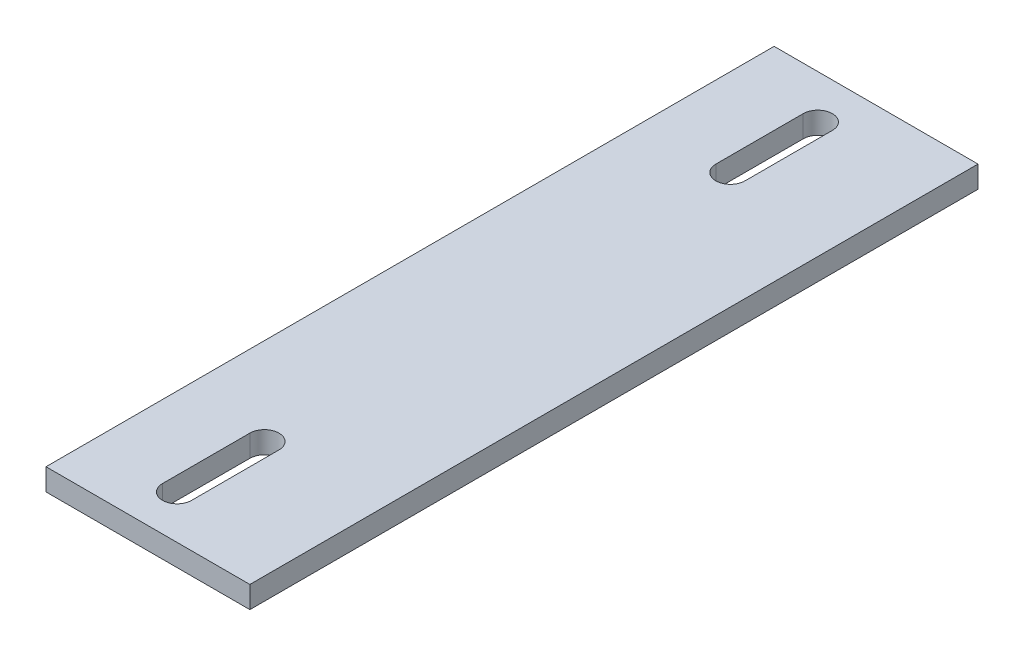
ISO-10303-21;
HEADER;
FILE_DESCRIPTION(('STEP AP214'),'2;1');
FILE_NAME('part.step','',(''),(''),'','','');
FILE_SCHEMA(('AUTOMOTIVE_DESIGN { 1 0 10303 214 1 1 1 1 }'));
ENDSEC;
DATA;
#1=APPLICATION_CONTEXT('core data for automotive mechanical design processes');
#2=APPLICATION_PROTOCOL_DEFINITION('international standard','automotive_design',2000,#1);
#3=PRODUCT_CONTEXT('',#1,'mechanical');
#4=PRODUCT('Part','Part','',(#3));
#5=PRODUCT_RELATED_PRODUCT_CATEGORY('part','',(#4));
#6=PRODUCT_DEFINITION_FORMATION('','',#4);
#7=PRODUCT_DEFINITION_CONTEXT('part definition',#1,'design');
#8=PRODUCT_DEFINITION('design','',#6,#7);
#9=PRODUCT_DEFINITION_SHAPE('','',#8);
#10=(LENGTH_UNIT() NAMED_UNIT(*) SI_UNIT(.MILLI.,.METRE.));
#11=(NAMED_UNIT(*) PLANE_ANGLE_UNIT() SI_UNIT($,.RADIAN.));
#12=(NAMED_UNIT(*) SI_UNIT($,.STERADIAN.) SOLID_ANGLE_UNIT());
#13=UNCERTAINTY_MEASURE_WITH_UNIT(LENGTH_MEASURE(1.E-05),#10,'distance_accuracy_value','');
#14=(GEOMETRIC_REPRESENTATION_CONTEXT(3) GLOBAL_UNCERTAINTY_ASSIGNED_CONTEXT((#13)) GLOBAL_UNIT_ASSIGNED_CONTEXT((#10,
#11,#12)) REPRESENTATION_CONTEXT('',''));
#15=CARTESIAN_POINT('',(0.,0.,0.));
#16=DIRECTION('',(0.,0.,1.));
#17=DIRECTION('',(1.,0.,0.));
#18=AXIS2_PLACEMENT_3D('',#15,#16,#17);
#19=CARTESIAN_POINT('',(-22.225,4.7625,-79.375));
#20=DIRECTION('',(1.,0.,0.));
#21=DIRECTION('',(0.,0.,-1.));
#22=AXIS2_PLACEMENT_3D('',#19,#20,#21);
#23=PLANE('',#22);
#24=DIRECTION('',(0.,0.,1.));
#25=VECTOR('',#24,1.);
#26=CARTESIAN_POINT('',(-22.225,0.,-79.375));
#27=LINE('',#26,#25);
#28=CARTESIAN_POINT('',(-22.225,0.,-79.375));
#29=VERTEX_POINT('',#28);
#30=CARTESIAN_POINT('',(-22.225,0.,79.375));
#31=VERTEX_POINT('',#30);
#32=EDGE_CURVE('E188',#29,#31,#27,.T.);
#33=ORIENTED_EDGE('',*,*,#32,.T.);
#34=DIRECTION('',(0.,-1.,0.));
#35=VECTOR('',#34,1.);
#36=CARTESIAN_POINT('',(-22.225,4.7625,79.375));
#37=LINE('',#36,#35);
#38=CARTESIAN_POINT('',(-22.225,4.7625,79.375));
#39=VERTEX_POINT('',#38);
#40=EDGE_CURVE('E11',#39,#31,#37,.T.);
#41=ORIENTED_EDGE('',*,*,#40,.F.);
#42=DIRECTION('',(0.,0.,1.));
#43=VECTOR('',#42,1.);
#44=CARTESIAN_POINT('',(-22.225,4.7625,-79.375));
#45=LINE('',#44,#43);
#46=CARTESIAN_POINT('',(-22.225,4.7625,-79.375));
#47=VERTEX_POINT('',#46);
#48=EDGE_CURVE('E195',#47,#39,#45,.T.);
#49=ORIENTED_EDGE('',*,*,#48,.F.);
#50=DIRECTION('',(0.,-1.,0.));
#51=VECTOR('',#50,1.);
#52=CARTESIAN_POINT('',(-22.225,4.7625,-79.375));
#53=LINE('',#52,#51);
#54=EDGE_CURVE('E206',#47,#29,#53,.T.);
#55=ORIENTED_EDGE('',*,*,#54,.T.);
#56=EDGE_LOOP('',(#33,#41,#49,#55));
#57=FACE_BOUND('',#56,.T.);
#58=ADVANCED_FACE('F39',(#57),#23,.F.);
#59=CARTESIAN_POINT('',(22.225,4.7625,79.375));
#60=DIRECTION('',(0.,0.,-1.));
#61=DIRECTION('',(-1.,0.,0.));
#62=AXIS2_PLACEMENT_3D('',#59,#60,#61);
#63=PLANE('',#62);
#64=DIRECTION('',(1.,0.,0.));
#65=VECTOR('',#64,1.);
#66=CARTESIAN_POINT('',(22.225,0.,79.375));
#67=LINE('',#66,#65);
#68=CARTESIAN_POINT('',(22.225,0.,79.375));
#69=VERTEX_POINT('',#68);
#70=EDGE_CURVE('E210',#31,#69,#67,.T.);
#71=ORIENTED_EDGE('',*,*,#70,.T.);
#72=DIRECTION('',(0.,-1.,0.));
#73=VECTOR('',#72,1.);
#74=CARTESIAN_POINT('',(22.225,4.7625,79.375));
#75=LINE('',#74,#73);
#76=CARTESIAN_POINT('',(22.225,4.7625,79.375));
#77=VERTEX_POINT('',#76);
#78=EDGE_CURVE('E46',#77,#69,#75,.T.);
#79=ORIENTED_EDGE('',*,*,#78,.F.);
#80=DIRECTION('',(1.,0.,0.));
#81=VECTOR('',#80,1.);
#82=CARTESIAN_POINT('',(22.225,4.7625,79.375));
#83=LINE('',#82,#81);
#84=EDGE_CURVE('E199',#39,#77,#83,.T.);
#85=ORIENTED_EDGE('',*,*,#84,.F.);
#86=ORIENTED_EDGE('',*,*,#40,.T.);
#87=EDGE_LOOP('',(#71,#79,#85,#86));
#88=FACE_BOUND('',#87,.T.);
#89=ADVANCED_FACE('F239',(#88),#63,.F.);
#90=CARTESIAN_POINT('',(22.225,4.7625,-79.375));
#91=DIRECTION('',(-1.,0.,0.));
#92=DIRECTION('',(0.,0.,1.));
#93=AXIS2_PLACEMENT_3D('',#90,#91,#92);
#94=PLANE('',#93);
#95=DIRECTION('',(0.,0.,-1.));
#96=VECTOR('',#95,1.);
#97=CARTESIAN_POINT('',(22.225,0.,-79.375));
#98=LINE('',#97,#96);
#99=CARTESIAN_POINT('',(22.225,0.,-79.375));
#100=VERTEX_POINT('',#99);
#101=EDGE_CURVE('E212',#69,#100,#98,.T.);
#102=ORIENTED_EDGE('',*,*,#101,.T.);
#103=DIRECTION('',(0.,-1.,0.));
#104=VECTOR('',#103,1.);
#105=CARTESIAN_POINT('',(22.225,4.7625,-79.375));
#106=LINE('',#105,#104);
#107=CARTESIAN_POINT('',(22.225,4.7625,-79.375));
#108=VERTEX_POINT('',#107);
#109=EDGE_CURVE('E217',#108,#100,#106,.T.);
#110=ORIENTED_EDGE('',*,*,#109,.F.);
#111=DIRECTION('',(0.,0.,-1.));
#112=VECTOR('',#111,1.);
#113=CARTESIAN_POINT('',(22.225,4.7625,-79.375));
#114=LINE('',#113,#112);
#115=EDGE_CURVE('E202',#77,#108,#114,.T.);
#116=ORIENTED_EDGE('',*,*,#115,.F.);
#117=ORIENTED_EDGE('',*,*,#78,.T.);
#118=EDGE_LOOP('',(#102,#110,#116,#117));
#119=FACE_BOUND('',#118,.T.);
#120=ADVANCED_FACE('F224',(#119),#94,.F.);
#121=CARTESIAN_POINT('',(22.225,4.7625,-79.375));
#122=DIRECTION('',(0.,0.,1.));
#123=DIRECTION('',(1.,0.,0.));
#124=AXIS2_PLACEMENT_3D('',#121,#122,#123);
#125=PLANE('',#124);
#126=DIRECTION('',(-1.,0.,0.));
#127=VECTOR('',#126,1.);
#128=CARTESIAN_POINT('',(22.225,0.,-79.375));
#129=LINE('',#128,#127);
#130=EDGE_CURVE('E200',#100,#29,#129,.T.);
#131=ORIENTED_EDGE('',*,*,#130,.T.);
#132=ORIENTED_EDGE('',*,*,#54,.F.);
#133=DIRECTION('',(-1.,0.,0.));
#134=VECTOR('',#133,1.);
#135=CARTESIAN_POINT('',(22.225,4.7625,-79.375));
#136=LINE('',#135,#134);
#137=EDGE_CURVE('E204',#108,#47,#136,.T.);
#138=ORIENTED_EDGE('',*,*,#137,.F.);
#139=ORIENTED_EDGE('',*,*,#109,.T.);
#140=EDGE_LOOP('',(#131,#132,#138,#139));
#141=FACE_BOUND('',#140,.T.);
#142=ADVANCED_FACE('F232',(#141),#125,.F.);
#143=CARTESIAN_POINT('',(-22.225,4.7625,79.375));
#144=DIRECTION('',(0.,-1.,0.));
#145=DIRECTION('',(0.,0.,-1.));
#146=AXIS2_PLACEMENT_3D('',#143,#144,#145);
#147=PLANE('',#146);
#148=CARTESIAN_POINT('',(-3.175,4.7625,69.85));
#149=DIRECTION('',(0.,1.,0.));
#150=DIRECTION('',(0.,0.,1.));
#151=AXIS2_PLACEMENT_3D('',#148,#149,#150);
#152=CIRCLE('',#151,3.175);
#153=CARTESIAN_POINT('',(-6.35000000000001,4.7625,69.85));
#154=VERTEX_POINT('',#153);
#155=CARTESIAN_POINT('',(0.,4.7625,69.85));
#156=VERTEX_POINT('',#155);
#157=EDGE_CURVE('E153',#154,#156,#152,.T.);
#158=ORIENTED_EDGE('',*,*,#157,.F.);
#159=DIRECTION('',(0.,0.,1.));
#160=VECTOR('',#159,1.);
#161=CARTESIAN_POINT('',(-6.35000000000002,4.7625,0.));
#162=LINE('',#161,#160);
#163=CARTESIAN_POINT('',(-6.35000000000001,4.7625,50.8));
#164=VERTEX_POINT('',#163);
#165=EDGE_CURVE('E53',#164,#154,#162,.T.);
#166=ORIENTED_EDGE('',*,*,#165,.F.);
#167=CARTESIAN_POINT('',(-3.17500000000001,4.7625,50.8));
#168=DIRECTION('',(0.,1.,0.));
#169=DIRECTION('',(0.,0.,1.));
#170=AXIS2_PLACEMENT_3D('',#167,#168,#169);
#171=CIRCLE('',#170,3.175);
#172=CARTESIAN_POINT('',(0.,4.7625,50.8));
#173=VERTEX_POINT('',#172);
#174=EDGE_CURVE('E144',#173,#164,#171,.T.);
#175=ORIENTED_EDGE('',*,*,#174,.F.);
#176=DIRECTION('',(0.,0.,1.));
#177=VECTOR('',#176,1.);
#178=CARTESIAN_POINT('',(0.,4.7625,0.));
#179=LINE('',#178,#177);
#180=EDGE_CURVE('E147',#173,#156,#179,.T.);
#181=ORIENTED_EDGE('',*,*,#180,.T.);
#182=EDGE_LOOP('',(#158,#166,#175,#181));
#183=FACE_BOUND('',#182,.T.);
#184=CARTESIAN_POINT('',(-3.17500000000001,4.7625,-69.85));
#185=DIRECTION('',(0.,1.,0.));
#186=DIRECTION('',(0.,0.,1.));
#187=AXIS2_PLACEMENT_3D('',#184,#185,#186);
#188=CIRCLE('',#187,3.175);
#189=CARTESIAN_POINT('',(0.,4.7625,-69.85));
#190=VERTEX_POINT('',#189);
#191=CARTESIAN_POINT('',(-6.35000000000001,4.7625,-69.85));
#192=VERTEX_POINT('',#191);
#193=EDGE_CURVE('E178',#190,#192,#188,.T.);
#194=ORIENTED_EDGE('',*,*,#193,.F.);
#195=DIRECTION('',(0.,0.,-1.));
#196=VECTOR('',#195,1.);
#197=CARTESIAN_POINT('',(0.,4.7625,0.));
#198=LINE('',#197,#196);
#199=CARTESIAN_POINT('',(0.,4.7625,-50.8));
#200=VERTEX_POINT('',#199);
#201=EDGE_CURVE('E159',#200,#190,#198,.T.);
#202=ORIENTED_EDGE('',*,*,#201,.F.);
#203=CARTESIAN_POINT('',(-3.175,4.7625,-50.8));
#204=DIRECTION('',(0.,1.,0.));
#205=DIRECTION('',(0.,0.,1.));
#206=AXIS2_PLACEMENT_3D('',#203,#204,#205);
#207=CIRCLE('',#206,3.175);
#208=CARTESIAN_POINT('',(-6.35,4.7625,-50.8));
#209=VERTEX_POINT('',#208);
#210=EDGE_CURVE('E167',#209,#200,#207,.T.);
#211=ORIENTED_EDGE('',*,*,#210,.F.);
#212=DIRECTION('',(0.,0.,-1.));
#213=VECTOR('',#212,1.);
#214=CARTESIAN_POINT('',(-6.34999999999999,4.7625,0.));
#215=LINE('',#214,#213);
#216=EDGE_CURVE('E181',#209,#192,#215,.T.);
#217=ORIENTED_EDGE('',*,*,#216,.T.);
#218=EDGE_LOOP('',(#194,#202,#211,#217));
#219=FACE_BOUND('',#218,.T.);
#220=ORIENTED_EDGE('',*,*,#48,.T.);
#221=ORIENTED_EDGE('',*,*,#84,.T.);
#222=ORIENTED_EDGE('',*,*,#115,.T.);
#223=ORIENTED_EDGE('',*,*,#137,.T.);
#224=EDGE_LOOP('',(#220,#221,#222,#223));
#225=FACE_BOUND('',#224,.T.);
#226=ADVANCED_FACE('F238',(#183,#219,#225),#147,.F.);
#227=CARTESIAN_POINT('',(-22.225,0.,79.375));
#228=DIRECTION('',(0.,-1.,0.));
#229=DIRECTION('',(0.,0.,-1.));
#230=AXIS2_PLACEMENT_3D('',#227,#228,#229);
#231=PLANE('',#230);
#232=DIRECTION('',(0.,0.,1.));
#233=VECTOR('',#232,1.);
#234=CARTESIAN_POINT('',(-6.35000000000002,0.,0.));
#235=LINE('',#234,#233);
#236=CARTESIAN_POINT('',(-6.35000000000001,0.,50.8));
#237=VERTEX_POINT('',#236);
#238=CARTESIAN_POINT('',(-6.35000000000001,0.,69.85));
#239=VERTEX_POINT('',#238);
#240=EDGE_CURVE('E129',#237,#239,#235,.T.);
#241=ORIENTED_EDGE('',*,*,#240,.T.);
#242=CARTESIAN_POINT('',(-3.175,0.,69.85));
#243=DIRECTION('',(0.,1.,0.));
#244=DIRECTION('',(0.,0.,1.));
#245=AXIS2_PLACEMENT_3D('',#242,#243,#244);
#246=CIRCLE('',#245,3.175);
#247=CARTESIAN_POINT('',(0.,0.,69.85));
#248=VERTEX_POINT('',#247);
#249=EDGE_CURVE('E135',#239,#248,#246,.T.);
#250=ORIENTED_EDGE('',*,*,#249,.T.);
#251=DIRECTION('',(0.,0.,1.));
#252=VECTOR('',#251,1.);
#253=CARTESIAN_POINT('',(0.,0.,0.));
#254=LINE('',#253,#252);
#255=CARTESIAN_POINT('',(0.,0.,50.8));
#256=VERTEX_POINT('',#255);
#257=EDGE_CURVE('E139',#256,#248,#254,.T.);
#258=ORIENTED_EDGE('',*,*,#257,.F.);
#259=CARTESIAN_POINT('',(-3.17500000000001,0.,50.8));
#260=DIRECTION('',(0.,1.,0.));
#261=DIRECTION('',(0.,0.,1.));
#262=AXIS2_PLACEMENT_3D('',#259,#260,#261);
#263=CIRCLE('',#262,3.175);
#264=EDGE_CURVE('E132',#256,#237,#263,.T.);
#265=ORIENTED_EDGE('',*,*,#264,.T.);
#266=EDGE_LOOP('',(#241,#250,#258,#265));
#267=FACE_BOUND('',#266,.T.);
#268=DIRECTION('',(0.,0.,-1.));
#269=VECTOR('',#268,1.);
#270=CARTESIAN_POINT('',(0.,0.,0.));
#271=LINE('',#270,#269);
#272=CARTESIAN_POINT('',(0.,0.,-50.8));
#273=VERTEX_POINT('',#272);
#274=CARTESIAN_POINT('',(0.,0.,-69.85));
#275=VERTEX_POINT('',#274);
#276=EDGE_CURVE('E163',#273,#275,#271,.T.);
#277=ORIENTED_EDGE('',*,*,#276,.T.);
#278=CARTESIAN_POINT('',(-3.17500000000001,0.,-69.85));
#279=DIRECTION('',(0.,1.,0.));
#280=DIRECTION('',(0.,0.,1.));
#281=AXIS2_PLACEMENT_3D('',#278,#279,#280);
#282=CIRCLE('',#281,3.175);
#283=CARTESIAN_POINT('',(-6.35000000000001,0.,-69.85));
#284=VERTEX_POINT('',#283);
#285=EDGE_CURVE('E166',#275,#284,#282,.T.);
#286=ORIENTED_EDGE('',*,*,#285,.T.);
#287=DIRECTION('',(0.,0.,-1.));
#288=VECTOR('',#287,1.);
#289=CARTESIAN_POINT('',(-6.34999999999999,0.,0.));
#290=LINE('',#289,#288);
#291=CARTESIAN_POINT('',(-6.35,0.,-50.8));
#292=VERTEX_POINT('',#291);
#293=EDGE_CURVE('E170',#292,#284,#290,.T.);
#294=ORIENTED_EDGE('',*,*,#293,.F.);
#295=CARTESIAN_POINT('',(-3.175,0.,-50.8));
#296=DIRECTION('',(0.,1.,0.));
#297=DIRECTION('',(0.,0.,1.));
#298=AXIS2_PLACEMENT_3D('',#295,#296,#297);
#299=CIRCLE('',#298,3.175);
#300=EDGE_CURVE('E173',#292,#273,#299,.T.);
#301=ORIENTED_EDGE('',*,*,#300,.T.);
#302=EDGE_LOOP('',(#277,#286,#294,#301));
#303=FACE_BOUND('',#302,.T.);
#304=ORIENTED_EDGE('',*,*,#32,.F.);
#305=ORIENTED_EDGE('',*,*,#130,.F.);
#306=ORIENTED_EDGE('',*,*,#101,.F.);
#307=ORIENTED_EDGE('',*,*,#70,.F.);
#308=EDGE_LOOP('',(#304,#305,#306,#307));
#309=FACE_BOUND('',#308,.T.);
#310=ADVANCED_FACE('F141',(#267,#303,#309),#231,.T.);
#311=CARTESIAN_POINT('',(0.,0.,0.));
#312=DIRECTION('',(1.,0.,0.));
#313=DIRECTION('',(0.,0.,-1.));
#314=AXIS2_PLACEMENT_3D('',#311,#312,#313);
#315=PLANE('',#314);
#316=ORIENTED_EDGE('',*,*,#201,.T.);
#317=DIRECTION('',(0.,1.,0.));
#318=VECTOR('',#317,1.);
#319=CARTESIAN_POINT('',(0.,0.,-69.85));
#320=LINE('',#319,#318);
#321=EDGE_CURVE('E176',#275,#190,#320,.T.);
#322=ORIENTED_EDGE('',*,*,#321,.F.);
#323=ORIENTED_EDGE('',*,*,#276,.F.);
#324=DIRECTION('',(0.,1.,0.));
#325=VECTOR('',#324,1.);
#326=CARTESIAN_POINT('',(0.,0.,-50.8));
#327=LINE('',#326,#325);
#328=EDGE_CURVE('E186',#273,#200,#327,.T.);
#329=ORIENTED_EDGE('',*,*,#328,.T.);
#330=EDGE_LOOP('',(#316,#322,#323,#329));
#331=FACE_BOUND('',#330,.T.);
#332=ADVANCED_FACE('F251',(#331),#315,.F.);
#333=CARTESIAN_POINT('',(-3.175,0.,-50.8));
#334=DIRECTION('',(0.,1.,0.));
#335=DIRECTION('',(0.,0.,1.));
#336=AXIS2_PLACEMENT_3D('',#333,#334,#335);
#337=CYLINDRICAL_SURFACE('',#336,3.175);
#338=ORIENTED_EDGE('',*,*,#210,.T.);
#339=ORIENTED_EDGE('',*,*,#328,.F.);
#340=ORIENTED_EDGE('',*,*,#300,.F.);
#341=DIRECTION('',(0.,1.,0.));
#342=VECTOR('',#341,1.);
#343=CARTESIAN_POINT('',(-6.35,0.,-50.8));
#344=LINE('',#343,#342);
#345=EDGE_CURVE('E189',#292,#209,#344,.T.);
#346=ORIENTED_EDGE('',*,*,#345,.T.);
#347=EDGE_LOOP('',(#338,#339,#340,#346));
#348=FACE_BOUND('',#347,.T.);
#349=ADVANCED_FACE('F257',(#348),#337,.F.);
#350=CARTESIAN_POINT('',(-6.34999999999999,0.,0.));
#351=DIRECTION('',(1.,0.,0.));
#352=DIRECTION('',(0.,0.,-1.));
#353=AXIS2_PLACEMENT_3D('',#350,#351,#352);
#354=PLANE('',#353);
#355=ORIENTED_EDGE('',*,*,#216,.F.);
#356=ORIENTED_EDGE('',*,*,#345,.F.);
#357=ORIENTED_EDGE('',*,*,#293,.T.);
#358=DIRECTION('',(0.,1.,0.));
#359=VECTOR('',#358,1.);
#360=CARTESIAN_POINT('',(-6.35000000000001,0.,-69.85));
#361=LINE('',#360,#359);
#362=EDGE_CURVE('E191',#284,#192,#361,.T.);
#363=ORIENTED_EDGE('',*,*,#362,.T.);
#364=EDGE_LOOP('',(#355,#356,#357,#363));
#365=FACE_BOUND('',#364,.T.);
#366=ADVANCED_FACE('F262',(#365),#354,.T.);
#367=CARTESIAN_POINT('',(-3.17500000000001,0.,-69.85));
#368=DIRECTION('',(0.,1.,0.));
#369=DIRECTION('',(0.,0.,1.));
#370=AXIS2_PLACEMENT_3D('',#367,#368,#369);
#371=CYLINDRICAL_SURFACE('',#370,3.175);
#372=ORIENTED_EDGE('',*,*,#193,.T.);
#373=ORIENTED_EDGE('',*,*,#362,.F.);
#374=ORIENTED_EDGE('',*,*,#285,.F.);
#375=ORIENTED_EDGE('',*,*,#321,.T.);
#376=EDGE_LOOP('',(#372,#373,#374,#375));
#377=FACE_BOUND('',#376,.T.);
#378=ADVANCED_FACE('F259',(#377),#371,.F.);
#379=CARTESIAN_POINT('',(-6.35000000000002,0.,0.));
#380=DIRECTION('',(-1.,0.,0.));
#381=DIRECTION('',(0.,0.,1.));
#382=AXIS2_PLACEMENT_3D('',#379,#380,#381);
#383=PLANE('',#382);
#384=ORIENTED_EDGE('',*,*,#165,.T.);
#385=DIRECTION('',(0.,1.,0.));
#386=VECTOR('',#385,1.);
#387=CARTESIAN_POINT('',(-6.35000000000001,0.,69.85));
#388=LINE('',#387,#386);
#389=EDGE_CURVE('E126',#239,#154,#388,.T.);
#390=ORIENTED_EDGE('',*,*,#389,.F.);
#391=ORIENTED_EDGE('',*,*,#240,.F.);
#392=DIRECTION('',(0.,1.,0.));
#393=VECTOR('',#392,1.);
#394=CARTESIAN_POINT('',(-6.35000000000001,0.,50.8));
#395=LINE('',#394,#393);
#396=EDGE_CURVE('E157',#237,#164,#395,.T.);
#397=ORIENTED_EDGE('',*,*,#396,.T.);
#398=EDGE_LOOP('',(#384,#390,#391,#397));
#399=FACE_BOUND('',#398,.T.);
#400=ADVANCED_FACE('F127',(#399),#383,.F.);
#401=CARTESIAN_POINT('',(-3.17500000000001,0.,50.8));
#402=DIRECTION('',(0.,1.,0.));
#403=DIRECTION('',(0.,0.,1.));
#404=AXIS2_PLACEMENT_3D('',#401,#402,#403);
#405=CYLINDRICAL_SURFACE('',#404,3.175);
#406=ORIENTED_EDGE('',*,*,#174,.T.);
#407=ORIENTED_EDGE('',*,*,#396,.F.);
#408=ORIENTED_EDGE('',*,*,#264,.F.);
#409=DIRECTION('',(0.,1.,0.));
#410=VECTOR('',#409,1.);
#411=CARTESIAN_POINT('',(0.,0.,50.8));
#412=LINE('',#411,#410);
#413=EDGE_CURVE('E160',#256,#173,#412,.T.);
#414=ORIENTED_EDGE('',*,*,#413,.T.);
#415=EDGE_LOOP('',(#406,#407,#408,#414));
#416=FACE_BOUND('',#415,.T.);
#417=ADVANCED_FACE('F272',(#416),#405,.F.);
#418=CARTESIAN_POINT('',(0.,0.,0.));
#419=DIRECTION('',(-1.,0.,0.));
#420=DIRECTION('',(0.,0.,1.));
#421=AXIS2_PLACEMENT_3D('',#418,#419,#420);
#422=PLANE('',#421);
#423=ORIENTED_EDGE('',*,*,#180,.F.);
#424=ORIENTED_EDGE('',*,*,#413,.F.);
#425=ORIENTED_EDGE('',*,*,#257,.T.);
#426=DIRECTION('',(0.,1.,0.));
#427=VECTOR('',#426,1.);
#428=CARTESIAN_POINT('',(0.,0.,69.85));
#429=LINE('',#428,#427);
#430=EDGE_CURVE('E61',#248,#156,#429,.T.);
#431=ORIENTED_EDGE('',*,*,#430,.T.);
#432=EDGE_LOOP('',(#423,#424,#425,#431));
#433=FACE_BOUND('',#432,.T.);
#434=ADVANCED_FACE('F275',(#433),#422,.T.);
#435=CARTESIAN_POINT('',(-3.175,0.,69.85));
#436=DIRECTION('',(0.,1.,0.));
#437=DIRECTION('',(0.,0.,1.));
#438=AXIS2_PLACEMENT_3D('',#435,#436,#437);
#439=CYLINDRICAL_SURFACE('',#438,3.175);
#440=ORIENTED_EDGE('',*,*,#157,.T.);
#441=ORIENTED_EDGE('',*,*,#430,.F.);
#442=ORIENTED_EDGE('',*,*,#249,.F.);
#443=ORIENTED_EDGE('',*,*,#389,.T.);
#444=EDGE_LOOP('',(#440,#441,#442,#443));
#445=FACE_BOUND('',#444,.T.);
#446=ADVANCED_FACE('F136',(#445),#439,.F.);
#447=CLOSED_SHELL('',(#58,#89,#120,#142,#226,#310,#332,#349,#366,#378,#400,#417,#434,#446));
#448=MANIFOLD_SOLID_BREP('B2',#447);
#449=ADVANCED_BREP_SHAPE_REPRESENTATION('',(#18,#448),#14);
#450=SHAPE_DEFINITION_REPRESENTATION(#9,#449);
ENDSEC;
END-ISO-10303-21;
